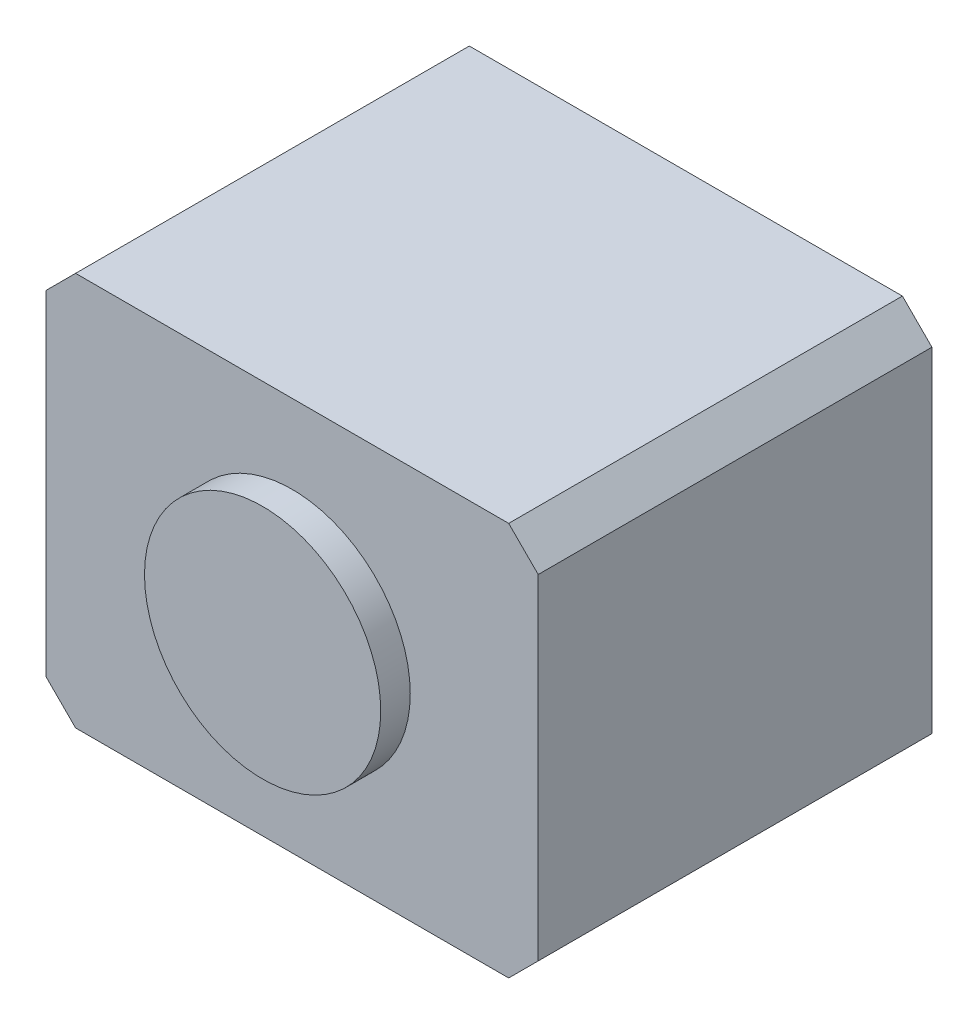
ISO-10303-21;
HEADER;
FILE_DESCRIPTION(('STEP AP214'),'2;1');
FILE_NAME('part.step','',(''),(''),'','','');
FILE_SCHEMA(('AUTOMOTIVE_DESIGN { 1 0 10303 214 1 1 1 1 }'));
ENDSEC;
DATA;
#1=APPLICATION_CONTEXT('core data for automotive mechanical design processes');
#2=APPLICATION_PROTOCOL_DEFINITION('international standard','automotive_design',2000,#1);
#3=PRODUCT_CONTEXT('',#1,'mechanical');
#4=PRODUCT('Part','Part','',(#3));
#5=PRODUCT_RELATED_PRODUCT_CATEGORY('part','',(#4));
#6=PRODUCT_DEFINITION_FORMATION('','',#4);
#7=PRODUCT_DEFINITION_CONTEXT('part definition',#1,'design');
#8=PRODUCT_DEFINITION('design','',#6,#7);
#9=PRODUCT_DEFINITION_SHAPE('','',#8);
#10=(LENGTH_UNIT() NAMED_UNIT(*) SI_UNIT(.MILLI.,.METRE.));
#11=(NAMED_UNIT(*) PLANE_ANGLE_UNIT() SI_UNIT($,.RADIAN.));
#12=(NAMED_UNIT(*) SI_UNIT($,.STERADIAN.) SOLID_ANGLE_UNIT());
#13=UNCERTAINTY_MEASURE_WITH_UNIT(LENGTH_MEASURE(1.E-05),#10,'distance_accuracy_value','');
#14=(GEOMETRIC_REPRESENTATION_CONTEXT(3) GLOBAL_UNCERTAINTY_ASSIGNED_CONTEXT((#13)) GLOBAL_UNIT_ASSIGNED_CONTEXT((#10,
#11,#12)) REPRESENTATION_CONTEXT('',''));
#15=CARTESIAN_POINT('',(0.,0.,0.));
#16=DIRECTION('',(0.,0.,1.));
#17=DIRECTION('',(1.,0.,0.));
#18=AXIS2_PLACEMENT_3D('',#15,#16,#17);
#19=CARTESIAN_POINT('',(12.5,-10.,20.));
#20=DIRECTION('',(-1.,0.,0.));
#21=DIRECTION('',(0.,0.,1.));
#22=AXIS2_PLACEMENT_3D('',#19,#20,#21);
#23=PLANE('',#22);
#24=DIRECTION('',(0.,1.,0.));
#25=VECTOR('',#24,1.);
#26=CARTESIAN_POINT('',(12.5,-10.,20.));
#27=LINE('',#26,#25);
#28=CARTESIAN_POINT('',(12.5,-8.5,20.));
#29=VERTEX_POINT('',#28);
#30=CARTESIAN_POINT('',(12.5,8.49999999999999,20.));
#31=VERTEX_POINT('',#30);
#32=EDGE_CURVE('E133',#29,#31,#27,.T.);
#33=ORIENTED_EDGE('',*,*,#32,.F.);
#34=DIRECTION('',(0.,0.,-1.));
#35=VECTOR('',#34,1.);
#36=CARTESIAN_POINT('',(12.5,-8.5,20.));
#37=LINE('',#36,#35);
#38=CARTESIAN_POINT('',(12.5,-8.5,0.));
#39=VERTEX_POINT('',#38);
#40=EDGE_CURVE('E41',#29,#39,#37,.T.);
#41=ORIENTED_EDGE('',*,*,#40,.T.);
#42=DIRECTION('',(0.,1.,0.));
#43=VECTOR('',#42,1.);
#44=CARTESIAN_POINT('',(12.5,-10.,0.));
#45=LINE('',#44,#43);
#46=CARTESIAN_POINT('',(12.5,8.49999999999999,0.));
#47=VERTEX_POINT('',#46);
#48=EDGE_CURVE('E135',#39,#47,#45,.T.);
#49=ORIENTED_EDGE('',*,*,#48,.T.);
#50=DIRECTION('',(0.,0.,1.));
#51=VECTOR('',#50,1.);
#52=CARTESIAN_POINT('',(12.5,8.49999999999999,20.));
#53=LINE('',#52,#51);
#54=EDGE_CURVE('E158',#47,#31,#53,.T.);
#55=ORIENTED_EDGE('',*,*,#54,.T.);
#56=EDGE_LOOP('',(#33,#41,#49,#55));
#57=FACE_BOUND('',#56,.T.);
#58=ADVANCED_FACE('F36',(#57),#23,.F.);
#59=CARTESIAN_POINT('',(-12.5,10.,20.));
#60=DIRECTION('',(0.,-1.,0.));
#61=DIRECTION('',(0.,0.,-1.));
#62=AXIS2_PLACEMENT_3D('',#59,#60,#61);
#63=PLANE('',#62);
#64=DIRECTION('',(-1.,0.,0.));
#65=VECTOR('',#64,1.);
#66=CARTESIAN_POINT('',(-12.5,10.,0.));
#67=LINE('',#66,#65);
#68=CARTESIAN_POINT('',(11.,10.,0.));
#69=VERTEX_POINT('',#68);
#70=CARTESIAN_POINT('',(-11.,10.,0.));
#71=VERTEX_POINT('',#70);
#72=EDGE_CURVE('E131',#69,#71,#67,.T.);
#73=ORIENTED_EDGE('',*,*,#72,.T.);
#74=DIRECTION('',(0.,0.,1.));
#75=VECTOR('',#74,1.);
#76=CARTESIAN_POINT('',(-11.,10.,20.));
#77=LINE('',#76,#75);
#78=CARTESIAN_POINT('',(-11.,10.,20.));
#79=VERTEX_POINT('',#78);
#80=EDGE_CURVE('E110',#71,#79,#77,.T.);
#81=ORIENTED_EDGE('',*,*,#80,.T.);
#82=DIRECTION('',(-1.,0.,0.));
#83=VECTOR('',#82,1.);
#84=CARTESIAN_POINT('',(-12.5,10.,20.));
#85=LINE('',#84,#83);
#86=CARTESIAN_POINT('',(11.,10.,20.));
#87=VERTEX_POINT('',#86);
#88=EDGE_CURVE('E175',#87,#79,#85,.T.);
#89=ORIENTED_EDGE('',*,*,#88,.F.);
#90=DIRECTION('',(0.,0.,-1.));
#91=VECTOR('',#90,1.);
#92=CARTESIAN_POINT('',(11.,10.,20.));
#93=LINE('',#92,#91);
#94=EDGE_CURVE('E115',#87,#69,#93,.T.);
#95=ORIENTED_EDGE('',*,*,#94,.T.);
#96=EDGE_LOOP('',(#73,#81,#89,#95));
#97=FACE_BOUND('',#96,.T.);
#98=ADVANCED_FACE('F184',(#97),#63,.F.);
#99=CARTESIAN_POINT('',(-12.5,-10.,20.));
#100=DIRECTION('',(1.,0.,0.));
#101=DIRECTION('',(0.,0.,-1.));
#102=AXIS2_PLACEMENT_3D('',#99,#100,#101);
#103=PLANE('',#102);
#104=DIRECTION('',(0.,-1.,0.));
#105=VECTOR('',#104,1.);
#106=CARTESIAN_POINT('',(-12.5,-10.,20.));
#107=LINE('',#106,#105);
#108=CARTESIAN_POINT('',(-12.5,8.5,20.));
#109=VERTEX_POINT('',#108);
#110=CARTESIAN_POINT('',(-12.5,-8.49999999999999,20.));
#111=VERTEX_POINT('',#110);
#112=EDGE_CURVE('E124',#109,#111,#107,.T.);
#113=ORIENTED_EDGE('',*,*,#112,.F.);
#114=DIRECTION('',(0.,0.,-1.));
#115=VECTOR('',#114,1.);
#116=CARTESIAN_POINT('',(-12.5,8.5,20.));
#117=LINE('',#116,#115);
#118=CARTESIAN_POINT('',(-12.5,8.5,0.));
#119=VERTEX_POINT('',#118);
#120=EDGE_CURVE('E109',#109,#119,#117,.T.);
#121=ORIENTED_EDGE('',*,*,#120,.T.);
#122=DIRECTION('',(0.,-1.,0.));
#123=VECTOR('',#122,1.);
#124=CARTESIAN_POINT('',(-12.5,-10.,0.));
#125=LINE('',#124,#123);
#126=CARTESIAN_POINT('',(-12.5,-8.49999999999999,0.));
#127=VERTEX_POINT('',#126);
#128=EDGE_CURVE('E122',#119,#127,#125,.T.);
#129=ORIENTED_EDGE('',*,*,#128,.T.);
#130=DIRECTION('',(0.,0.,1.));
#131=VECTOR('',#130,1.);
#132=CARTESIAN_POINT('',(-12.5,-8.49999999999999,20.));
#133=LINE('',#132,#131);
#134=EDGE_CURVE('E126',#127,#111,#133,.T.);
#135=ORIENTED_EDGE('',*,*,#134,.T.);
#136=EDGE_LOOP('',(#113,#121,#129,#135));
#137=FACE_BOUND('',#136,.T.);
#138=ADVANCED_FACE('F121',(#137),#103,.F.);
#139=CARTESIAN_POINT('',(-12.5,-10.,20.));
#140=DIRECTION('',(0.,1.,0.));
#141=DIRECTION('',(0.,0.,1.));
#142=AXIS2_PLACEMENT_3D('',#139,#140,#141);
#143=PLANE('',#142);
#144=DIRECTION('',(1.,0.,0.));
#145=VECTOR('',#144,1.);
#146=CARTESIAN_POINT('',(-12.5,-10.,20.));
#147=LINE('',#146,#145);
#148=CARTESIAN_POINT('',(-11.,-10.,20.));
#149=VERTEX_POINT('',#148);
#150=CARTESIAN_POINT('',(11.,-10.,20.));
#151=VERTEX_POINT('',#150);
#152=EDGE_CURVE('E139',#149,#151,#147,.T.);
#153=ORIENTED_EDGE('',*,*,#152,.F.);
#154=DIRECTION('',(0.,0.,-1.));
#155=VECTOR('',#154,1.);
#156=CARTESIAN_POINT('',(-11.,-10.,20.));
#157=LINE('',#156,#155);
#158=CARTESIAN_POINT('',(-11.,-10.,0.));
#159=VERTEX_POINT('',#158);
#160=EDGE_CURVE('E156',#149,#159,#157,.T.);
#161=ORIENTED_EDGE('',*,*,#160,.T.);
#162=DIRECTION('',(1.,0.,0.));
#163=VECTOR('',#162,1.);
#164=CARTESIAN_POINT('',(-12.5,-10.,0.));
#165=LINE('',#164,#163);
#166=CARTESIAN_POINT('',(11.,-10.,0.));
#167=VERTEX_POINT('',#166);
#168=EDGE_CURVE('E130',#159,#167,#165,.T.);
#169=ORIENTED_EDGE('',*,*,#168,.T.);
#170=DIRECTION('',(0.,0.,1.));
#171=VECTOR('',#170,1.);
#172=CARTESIAN_POINT('',(11.,-10.,20.));
#173=LINE('',#172,#171);
#174=EDGE_CURVE('E53',#167,#151,#173,.T.);
#175=ORIENTED_EDGE('',*,*,#174,.T.);
#176=EDGE_LOOP('',(#153,#161,#169,#175));
#177=FACE_BOUND('',#176,.T.);
#178=ADVANCED_FACE('F188',(#177),#143,.F.);
#179=CARTESIAN_POINT('',(0.,0.,20.));
#180=DIRECTION('',(0.,0.,-1.));
#181=DIRECTION('',(-1.,0.,0.));
#182=AXIS2_PLACEMENT_3D('',#179,#180,#181);
#183=PLANE('',#182);
#184=CARTESIAN_POINT('',(0.,0.,20.));
#185=DIRECTION('',(0.,0.,1.));
#186=DIRECTION('',(1.,0.,0.));
#187=AXIS2_PLACEMENT_3D('',#184,#185,#186);
#188=CIRCLE('',#187,6.);
#189=CARTESIAN_POINT('',(6.,0.,20.));
#190=VERTEX_POINT('',#189);
#191=EDGE_CURVE('E11',#190,#190,#188,.T.);
#192=ORIENTED_EDGE('',*,*,#191,.F.);
#193=EDGE_LOOP('',(#192));
#194=FACE_BOUND('',#193,.T.);
#195=ORIENTED_EDGE('',*,*,#88,.T.);
#196=DIRECTION('',(0.707106781186548,0.707106781186547,0.));
#197=VECTOR('',#196,1.);
#198=CARTESIAN_POINT('',(-12.5,8.5,20.));
#199=LINE('',#198,#197);
#200=EDGE_CURVE('E153',#79,#109,#199,.F.);
#201=ORIENTED_EDGE('',*,*,#200,.T.);
#202=ORIENTED_EDGE('',*,*,#112,.T.);
#203=DIRECTION('',(-0.707106781186547,0.707106781186548,0.));
#204=VECTOR('',#203,1.);
#205=CARTESIAN_POINT('',(-11.,-10.,20.));
#206=LINE('',#205,#204);
#207=EDGE_CURVE('E60',#111,#149,#206,.F.);
#208=ORIENTED_EDGE('',*,*,#207,.T.);
#209=ORIENTED_EDGE('',*,*,#152,.T.);
#210=DIRECTION('',(-0.707106781186548,-0.707106781186547,0.));
#211=VECTOR('',#210,1.);
#212=CARTESIAN_POINT('',(12.5,-8.5,20.));
#213=LINE('',#212,#211);
#214=EDGE_CURVE('E150',#151,#29,#213,.F.);
#215=ORIENTED_EDGE('',*,*,#214,.T.);
#216=ORIENTED_EDGE('',*,*,#32,.T.);
#217=DIRECTION('',(0.707106781186547,-0.707106781186548,0.));
#218=VECTOR('',#217,1.);
#219=CARTESIAN_POINT('',(11.,10.,20.));
#220=LINE('',#219,#218);
#221=EDGE_CURVE('E148',#31,#87,#220,.F.);
#222=ORIENTED_EDGE('',*,*,#221,.T.);
#223=EDGE_LOOP('',(#195,#201,#202,#208,#209,#215,#216,#222));
#224=FACE_BOUND('',#223,.T.);
#225=ADVANCED_FACE('F179',(#194,#224),#183,.F.);
#226=CARTESIAN_POINT('',(0.,0.,0.));
#227=DIRECTION('',(0.,0.,-1.));
#228=DIRECTION('',(-1.,0.,0.));
#229=AXIS2_PLACEMENT_3D('',#226,#227,#228);
#230=PLANE('',#229);
#231=ORIENTED_EDGE('',*,*,#128,.F.);
#232=DIRECTION('',(-0.707106781186548,-0.707106781186547,0.));
#233=VECTOR('',#232,1.);
#234=CARTESIAN_POINT('',(-10.5,10.5,0.));
#235=LINE('',#234,#233);
#236=EDGE_CURVE('E105',#119,#71,#235,.F.);
#237=ORIENTED_EDGE('',*,*,#236,.T.);
#238=ORIENTED_EDGE('',*,*,#72,.F.);
#239=DIRECTION('',(-0.707106781186547,0.707106781186548,0.));
#240=VECTOR('',#239,1.);
#241=CARTESIAN_POINT('',(10.5,10.5,0.));
#242=LINE('',#241,#240);
#243=EDGE_CURVE('E125',#69,#47,#242,.F.);
#244=ORIENTED_EDGE('',*,*,#243,.T.);
#245=ORIENTED_EDGE('',*,*,#48,.F.);
#246=DIRECTION('',(0.707106781186548,0.707106781186547,0.));
#247=VECTOR('',#246,1.);
#248=CARTESIAN_POINT('',(10.5,-10.5,0.));
#249=LINE('',#248,#247);
#250=EDGE_CURVE('E142',#39,#167,#249,.F.);
#251=ORIENTED_EDGE('',*,*,#250,.T.);
#252=ORIENTED_EDGE('',*,*,#168,.F.);
#253=DIRECTION('',(0.707106781186547,-0.707106781186548,0.));
#254=VECTOR('',#253,1.);
#255=CARTESIAN_POINT('',(-10.5,-10.5,0.));
#256=LINE('',#255,#254);
#257=EDGE_CURVE('E116',#159,#127,#256,.F.);
#258=ORIENTED_EDGE('',*,*,#257,.T.);
#259=EDGE_LOOP('',(#231,#237,#238,#244,#245,#251,#252,#258));
#260=FACE_BOUND('',#259,.T.);
#261=ADVANCED_FACE('F128',(#260),#230,.T.);
#262=CARTESIAN_POINT('',(-12.5,8.5,20.));
#263=DIRECTION('',(0.707106781186547,-0.707106781186548,0.));
#264=DIRECTION('',(0.,0.,-1.));
#265=AXIS2_PLACEMENT_3D('',#262,#263,#264);
#266=PLANE('',#265);
#267=ORIENTED_EDGE('',*,*,#200,.F.);
#268=ORIENTED_EDGE('',*,*,#80,.F.);
#269=ORIENTED_EDGE('',*,*,#236,.F.);
#270=ORIENTED_EDGE('',*,*,#120,.F.);
#271=EDGE_LOOP('',(#267,#268,#269,#270));
#272=FACE_BOUND('',#271,.T.);
#273=ADVANCED_FACE('F108',(#272),#266,.F.);
#274=CARTESIAN_POINT('',(-11.,-10.,20.));
#275=DIRECTION('',(0.707106781186548,0.707106781186547,0.));
#276=DIRECTION('',(0.,0.,-1.));
#277=AXIS2_PLACEMENT_3D('',#274,#275,#276);
#278=PLANE('',#277);
#279=ORIENTED_EDGE('',*,*,#207,.F.);
#280=ORIENTED_EDGE('',*,*,#134,.F.);
#281=ORIENTED_EDGE('',*,*,#257,.F.);
#282=ORIENTED_EDGE('',*,*,#160,.F.);
#283=EDGE_LOOP('',(#279,#280,#281,#282));
#284=FACE_BOUND('',#283,.T.);
#285=ADVANCED_FACE('F187',(#284),#278,.F.);
#286=CARTESIAN_POINT('',(12.5,-8.5,20.));
#287=DIRECTION('',(-0.707106781186547,0.707106781186548,0.));
#288=DIRECTION('',(0.,0.,-1.));
#289=AXIS2_PLACEMENT_3D('',#286,#287,#288);
#290=PLANE('',#289);
#291=ORIENTED_EDGE('',*,*,#214,.F.);
#292=ORIENTED_EDGE('',*,*,#174,.F.);
#293=ORIENTED_EDGE('',*,*,#250,.F.);
#294=ORIENTED_EDGE('',*,*,#40,.F.);
#295=EDGE_LOOP('',(#291,#292,#293,#294));
#296=FACE_BOUND('',#295,.T.);
#297=ADVANCED_FACE('F189',(#296),#290,.F.);
#298=CARTESIAN_POINT('',(11.,10.,20.));
#299=DIRECTION('',(-0.707106781186548,-0.707106781186547,0.));
#300=DIRECTION('',(0.,0.,-1.));
#301=AXIS2_PLACEMENT_3D('',#298,#299,#300);
#302=PLANE('',#301);
#303=ORIENTED_EDGE('',*,*,#221,.F.);
#304=ORIENTED_EDGE('',*,*,#54,.F.);
#305=ORIENTED_EDGE('',*,*,#243,.F.);
#306=ORIENTED_EDGE('',*,*,#94,.F.);
#307=EDGE_LOOP('',(#303,#304,#305,#306));
#308=FACE_BOUND('',#307,.T.);
#309=ADVANCED_FACE('F39',(#308),#302,.F.);
#310=CARTESIAN_POINT('',(0.,0.,21.5));
#311=DIRECTION('',(0.,0.,-1.));
#312=DIRECTION('',(-1.,0.,0.));
#313=AXIS2_PLACEMENT_3D('',#310,#311,#312);
#314=CYLINDRICAL_SURFACE('',#313,6.);
#315=CARTESIAN_POINT('',(0.,0.,21.5));
#316=DIRECTION('',(0.,0.,1.));
#317=DIRECTION('',(1.,0.,0.));
#318=AXIS2_PLACEMENT_3D('',#315,#316,#317);
#319=CIRCLE('',#318,6.);
#320=CARTESIAN_POINT('',(6.,0.,21.5));
#321=VERTEX_POINT('',#320);
#322=EDGE_CURVE('E169',#321,#321,#319,.T.);
#323=ORIENTED_EDGE('',*,*,#322,.F.);
#324=EDGE_LOOP('',(#323));
#325=FACE_BOUND('',#324,.T.);
#326=ORIENTED_EDGE('',*,*,#191,.T.);
#327=EDGE_LOOP('',(#326));
#328=FACE_BOUND('',#327,.T.);
#329=ADVANCED_FACE('F195',(#325,#328),#314,.T.);
#330=CARTESIAN_POINT('',(0.,0.,21.5));
#331=DIRECTION('',(0.,0.,1.));
#332=DIRECTION('',(1.,0.,0.));
#333=AXIS2_PLACEMENT_3D('',#330,#331,#332);
#334=PLANE('',#333);
#335=ORIENTED_EDGE('',*,*,#322,.T.);
#336=EDGE_LOOP('',(#335));
#337=FACE_BOUND('',#336,.T.);
#338=ADVANCED_FACE('F256',(#337),#334,.T.);
#339=CLOSED_SHELL('',(#58,#98,#138,#178,#225,#261,#273,#285,#297,#309,#329,#338));
#340=MANIFOLD_SOLID_BREP('B2',#339);
#341=ADVANCED_BREP_SHAPE_REPRESENTATION('',(#18,#340),#14);
#342=SHAPE_DEFINITION_REPRESENTATION(#9,#341);
ENDSEC;
END-ISO-10303-21;
